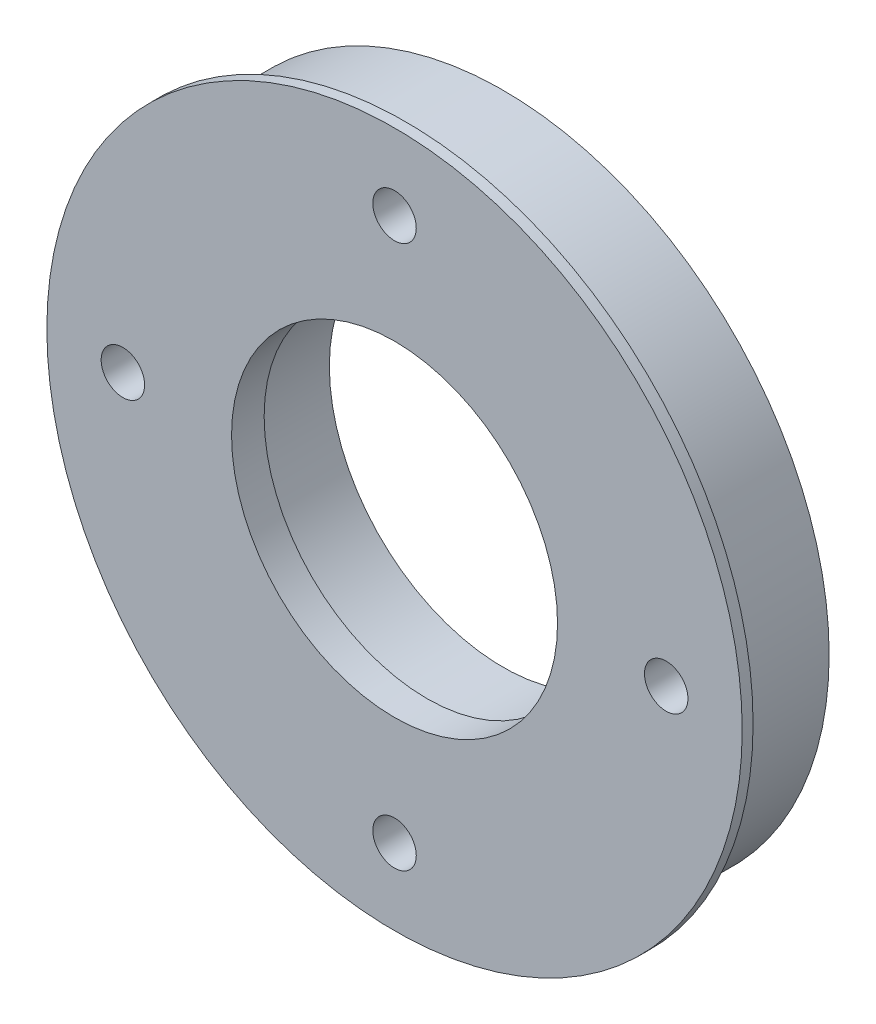
ISO-10303-21;
HEADER;
FILE_DESCRIPTION(('STEP AP214'),'2;1');
FILE_NAME('part.step','',(''),(''),'','','');
FILE_SCHEMA(('AUTOMOTIVE_DESIGN { 1 0 10303 214 1 1 1 1 }'));
ENDSEC;
DATA;
#1=APPLICATION_CONTEXT('core data for automotive mechanical design processes');
#2=APPLICATION_PROTOCOL_DEFINITION('international standard','automotive_design',2000,#1);
#3=PRODUCT_CONTEXT('',#1,'mechanical');
#4=PRODUCT('Part','Part','',(#3));
#5=PRODUCT_RELATED_PRODUCT_CATEGORY('part','',(#4));
#6=PRODUCT_DEFINITION_FORMATION('','',#4);
#7=PRODUCT_DEFINITION_CONTEXT('part definition',#1,'design');
#8=PRODUCT_DEFINITION('design','',#6,#7);
#9=PRODUCT_DEFINITION_SHAPE('','',#8);
#10=(LENGTH_UNIT() NAMED_UNIT(*) SI_UNIT(.MILLI.,.METRE.));
#11=(NAMED_UNIT(*) PLANE_ANGLE_UNIT() SI_UNIT($,.RADIAN.));
#12=(NAMED_UNIT(*) SI_UNIT($,.STERADIAN.) SOLID_ANGLE_UNIT());
#13=UNCERTAINTY_MEASURE_WITH_UNIT(LENGTH_MEASURE(1.E-05),#10,'distance_accuracy_value','');
#14=(GEOMETRIC_REPRESENTATION_CONTEXT(3) GLOBAL_UNCERTAINTY_ASSIGNED_CONTEXT((#13)) GLOBAL_UNIT_ASSIGNED_CONTEXT((#10,
#11,#12)) REPRESENTATION_CONTEXT('',''));
#15=CARTESIAN_POINT('',(0.,0.,0.));
#16=DIRECTION('',(0.,0.,1.));
#17=DIRECTION('',(1.,0.,0.));
#18=AXIS2_PLACEMENT_3D('',#15,#16,#17);
#19=CARTESIAN_POINT('',(0.,0.,-7.));
#20=DIRECTION('',(0.,0.,1.));
#21=DIRECTION('',(1.,0.,0.));
#22=AXIS2_PLACEMENT_3D('',#19,#20,#21);
#23=CYLINDRICAL_SURFACE('',#22,29.9974);
#24=CARTESIAN_POINT('',(0.,0.,2.));
#25=DIRECTION('',(0.,0.,1.));
#26=DIRECTION('',(1.,0.,0.));
#27=AXIS2_PLACEMENT_3D('',#24,#25,#26);
#28=CIRCLE('',#27,29.9974);
#29=CARTESIAN_POINT('',(29.9974,0.,2.));
#30=VERTEX_POINT('',#29);
#31=EDGE_CURVE('E63',#30,#30,#28,.F.);
#32=ORIENTED_EDGE('',*,*,#31,.T.);
#33=EDGE_LOOP('',(#32));
#34=FACE_BOUND('',#33,.T.);
#35=CARTESIAN_POINT('',(0.,0.,-7.));
#36=DIRECTION('',(0.,0.,1.));
#37=DIRECTION('',(1.,0.,0.));
#38=AXIS2_PLACEMENT_3D('',#35,#36,#37);
#39=CIRCLE('',#38,29.9974);
#40=CARTESIAN_POINT('',(29.9974,0.,-7.));
#41=VERTEX_POINT('',#40);
#42=EDGE_CURVE('E11',#41,#41,#39,.T.);
#43=ORIENTED_EDGE('',*,*,#42,.T.);
#44=EDGE_LOOP('',(#43));
#45=FACE_BOUND('',#44,.T.);
#46=ADVANCED_FACE('F50',(#34,#45),#23,.T.);
#47=CARTESIAN_POINT('',(25.,0.,-10.));
#48=DIRECTION('',(0.,0.,1.));
#49=DIRECTION('',(1.,0.,0.));
#50=AXIS2_PLACEMENT_3D('',#47,#48,#49);
#51=CYLINDRICAL_SURFACE('',#50,2.);
#52=CARTESIAN_POINT('',(25.,0.,3.));
#53=DIRECTION('',(0.,0.,1.));
#54=DIRECTION('',(1.,0.,0.));
#55=AXIS2_PLACEMENT_3D('',#52,#53,#54);
#56=CIRCLE('',#55,2.);
#57=CARTESIAN_POINT('',(27.,0.,3.));
#58=VERTEX_POINT('',#57);
#59=EDGE_CURVE('E54',#58,#58,#56,.T.);
#60=ORIENTED_EDGE('',*,*,#59,.T.);
#61=EDGE_LOOP('',(#60));
#62=FACE_BOUND('',#61,.T.);
#63=CARTESIAN_POINT('',(25.,0.,-7.));
#64=DIRECTION('',(0.,0.,-1.));
#65=DIRECTION('',(-1.,0.,0.));
#66=AXIS2_PLACEMENT_3D('',#63,#64,#65);
#67=CIRCLE('',#66,2.);
#68=CARTESIAN_POINT('',(23.,0.,-7.));
#69=VERTEX_POINT('',#68);
#70=EDGE_CURVE('E121',#69,#69,#67,.F.);
#71=ORIENTED_EDGE('',*,*,#70,.F.);
#72=EDGE_LOOP('',(#71));
#73=FACE_BOUND('',#72,.T.);
#74=ADVANCED_FACE('F153',(#62,#73),#51,.F.);
#75=CARTESIAN_POINT('',(0.,-25.,-10.));
#76=DIRECTION('',(0.,0.,1.));
#77=DIRECTION('',(1.,0.,0.));
#78=AXIS2_PLACEMENT_3D('',#75,#76,#77);
#79=CYLINDRICAL_SURFACE('',#78,2.00000000000001);
#80=CARTESIAN_POINT('',(0.,-25.,3.));
#81=DIRECTION('',(0.,0.,1.));
#82=DIRECTION('',(1.,0.,0.));
#83=AXIS2_PLACEMENT_3D('',#80,#81,#82);
#84=CIRCLE('',#83,2.00000000000001);
#85=CARTESIAN_POINT('',(2.,-25.,3.));
#86=VERTEX_POINT('',#85);
#87=EDGE_CURVE('E67',#86,#86,#84,.T.);
#88=ORIENTED_EDGE('',*,*,#87,.T.);
#89=EDGE_LOOP('',(#88));
#90=FACE_BOUND('',#89,.T.);
#91=CARTESIAN_POINT('',(0.,-25.,-7.));
#92=DIRECTION('',(0.,0.,-1.));
#93=DIRECTION('',(-1.,0.,0.));
#94=AXIS2_PLACEMENT_3D('',#91,#92,#93);
#95=CIRCLE('',#94,2.00000000000001);
#96=CARTESIAN_POINT('',(-2.00000000000001,-25.,-7.));
#97=VERTEX_POINT('',#96);
#98=EDGE_CURVE('E123',#97,#97,#95,.F.);
#99=ORIENTED_EDGE('',*,*,#98,.F.);
#100=EDGE_LOOP('',(#99));
#101=FACE_BOUND('',#100,.T.);
#102=ADVANCED_FACE('F149',(#90,#101),#79,.F.);
#103=CARTESIAN_POINT('',(-25.,0.,-10.));
#104=DIRECTION('',(0.,0.,1.));
#105=DIRECTION('',(1.,0.,0.));
#106=AXIS2_PLACEMENT_3D('',#103,#104,#105);
#107=CYLINDRICAL_SURFACE('',#106,2.);
#108=CARTESIAN_POINT('',(-25.,0.,3.));
#109=DIRECTION('',(0.,0.,1.));
#110=DIRECTION('',(1.,0.,0.));
#111=AXIS2_PLACEMENT_3D('',#108,#109,#110);
#112=CIRCLE('',#111,2.);
#113=CARTESIAN_POINT('',(-23.,0.,3.));
#114=VERTEX_POINT('',#113);
#115=EDGE_CURVE('E70',#114,#114,#112,.T.);
#116=ORIENTED_EDGE('',*,*,#115,.T.);
#117=EDGE_LOOP('',(#116));
#118=FACE_BOUND('',#117,.T.);
#119=CARTESIAN_POINT('',(-25.,0.,-7.));
#120=DIRECTION('',(0.,0.,-1.));
#121=DIRECTION('',(-1.,0.,0.));
#122=AXIS2_PLACEMENT_3D('',#119,#120,#121);
#123=CIRCLE('',#122,2.);
#124=CARTESIAN_POINT('',(-27.,0.,-7.));
#125=VERTEX_POINT('',#124);
#126=EDGE_CURVE('E127',#125,#125,#123,.F.);
#127=ORIENTED_EDGE('',*,*,#126,.F.);
#128=EDGE_LOOP('',(#127));
#129=FACE_BOUND('',#128,.T.);
#130=ADVANCED_FACE('F140',(#118,#129),#107,.F.);
#131=CARTESIAN_POINT('',(0.,25.,-10.));
#132=DIRECTION('',(0.,0.,1.));
#133=DIRECTION('',(1.,0.,0.));
#134=AXIS2_PLACEMENT_3D('',#131,#132,#133);
#135=CYLINDRICAL_SURFACE('',#134,2.00000000000001);
#136=CARTESIAN_POINT('',(0.,25.,3.));
#137=DIRECTION('',(0.,0.,1.));
#138=DIRECTION('',(1.,0.,0.));
#139=AXIS2_PLACEMENT_3D('',#136,#137,#138);
#140=CIRCLE('',#139,2.00000000000001);
#141=CARTESIAN_POINT('',(2.,25.,3.));
#142=VERTEX_POINT('',#141);
#143=EDGE_CURVE('E73',#142,#142,#140,.T.);
#144=ORIENTED_EDGE('',*,*,#143,.T.);
#145=EDGE_LOOP('',(#144));
#146=FACE_BOUND('',#145,.T.);
#147=CARTESIAN_POINT('',(0.,25.,-7.));
#148=DIRECTION('',(0.,0.,-1.));
#149=DIRECTION('',(-1.,0.,0.));
#150=AXIS2_PLACEMENT_3D('',#147,#148,#149);
#151=CIRCLE('',#150,2.00000000000001);
#152=CARTESIAN_POINT('',(-2.00000000000001,25.,-7.));
#153=VERTEX_POINT('',#152);
#154=EDGE_CURVE('E132',#153,#153,#151,.F.);
#155=ORIENTED_EDGE('',*,*,#154,.F.);
#156=EDGE_LOOP('',(#155));
#157=FACE_BOUND('',#156,.T.);
#158=ADVANCED_FACE('F138',(#146,#157),#135,.F.);
#159=CARTESIAN_POINT('',(0.,0.,-7.));
#160=DIRECTION('',(0.,0.,1.));
#161=DIRECTION('',(1.,0.,0.));
#162=AXIS2_PLACEMENT_3D('',#159,#160,#161);
#163=PLANE('',#162);
#164=CARTESIAN_POINT('',(0.,0.,-7.));
#165=DIRECTION('',(0.,0.,1.));
#166=DIRECTION('',(1.,0.,0.));
#167=AXIS2_PLACEMENT_3D('',#164,#165,#166);
#168=CIRCLE('',#167,16.);
#169=CARTESIAN_POINT('',(16.,0.,-7.));
#170=VERTEX_POINT('',#169);
#171=EDGE_CURVE('E58',#170,#170,#168,.T.);
#172=ORIENTED_EDGE('',*,*,#171,.T.);
#173=EDGE_LOOP('',(#172));
#174=FACE_BOUND('',#173,.T.);
#175=ORIENTED_EDGE('',*,*,#42,.F.);
#176=EDGE_LOOP('',(#175));
#177=FACE_BOUND('',#176,.T.);
#178=ORIENTED_EDGE('',*,*,#98,.T.);
#179=EDGE_LOOP('',(#178));
#180=FACE_BOUND('',#179,.T.);
#181=ORIENTED_EDGE('',*,*,#126,.T.);
#182=EDGE_LOOP('',(#181));
#183=FACE_BOUND('',#182,.T.);
#184=ORIENTED_EDGE('',*,*,#154,.T.);
#185=EDGE_LOOP('',(#184));
#186=FACE_BOUND('',#185,.T.);
#187=ORIENTED_EDGE('',*,*,#70,.T.);
#188=EDGE_LOOP('',(#187));
#189=FACE_BOUND('',#188,.T.);
#190=ADVANCED_FACE('F136',(#174,#177,#180,#183,#186,#189),#163,.F.);
#191=CARTESIAN_POINT('',(1.13985098899291E-13,-1.1836284832237E-13,-1.));
#192=DIRECTION('',(0.,0.,1.));
#193=DIRECTION('',(1.,0.,0.));
#194=AXIS2_PLACEMENT_3D('',#191,#192,#193);
#195=CYLINDRICAL_SURFACE('',#194,15.0000000000005);
#196=CARTESIAN_POINT('',(1.13985098899291E-13,-1.1836284832237E-13,0.));
#197=DIRECTION('',(0.,0.,-1.));
#198=DIRECTION('',(-1.,0.,0.));
#199=AXIS2_PLACEMENT_3D('',#196,#197,#198);
#200=CIRCLE('',#199,15.0000000000005);
#201=CARTESIAN_POINT('',(-15.0000000000004,-1.1836284832237E-13,0.));
#202=VERTEX_POINT('',#201);
#203=EDGE_CURVE('E78',#202,#202,#200,.T.);
#204=ORIENTED_EDGE('',*,*,#203,.T.);
#205=EDGE_LOOP('',(#204));
#206=FACE_BOUND('',#205,.T.);
#207=CARTESIAN_POINT('',(1.13985098899291E-13,-1.1836284832237E-13,3.));
#208=DIRECTION('',(0.,0.,1.));
#209=DIRECTION('',(1.,0.,0.));
#210=AXIS2_PLACEMENT_3D('',#207,#208,#209);
#211=CIRCLE('',#210,15.0000000000005);
#212=CARTESIAN_POINT('',(15.0000000000006,-1.1836284832237E-13,3.));
#213=VERTEX_POINT('',#212);
#214=EDGE_CURVE('E71',#213,#213,#211,.T.);
#215=ORIENTED_EDGE('',*,*,#214,.T.);
#216=EDGE_LOOP('',(#215));
#217=FACE_BOUND('',#216,.T.);
#218=ADVANCED_FACE('F146',(#206,#217),#195,.F.);
#219=CARTESIAN_POINT('',(0.,0.,-7.));
#220=DIRECTION('',(0.,0.,1.));
#221=DIRECTION('',(1.,0.,0.));
#222=AXIS2_PLACEMENT_3D('',#219,#220,#221);
#223=CYLINDRICAL_SURFACE('',#222,16.);
#224=ORIENTED_EDGE('',*,*,#171,.F.);
#225=EDGE_LOOP('',(#224));
#226=FACE_BOUND('',#225,.T.);
#227=CARTESIAN_POINT('',(0.,0.,0.));
#228=DIRECTION('',(0.,0.,-1.));
#229=DIRECTION('',(-1.,0.,0.));
#230=AXIS2_PLACEMENT_3D('',#227,#228,#229);
#231=CIRCLE('',#230,16.);
#232=CARTESIAN_POINT('',(-16.,0.,0.));
#233=VERTEX_POINT('',#232);
#234=EDGE_CURVE('E82',#233,#233,#231,.T.);
#235=ORIENTED_EDGE('',*,*,#234,.F.);
#236=EDGE_LOOP('',(#235));
#237=FACE_BOUND('',#236,.T.);
#238=ADVANCED_FACE('F52',(#226,#237),#223,.F.);
#239=CARTESIAN_POINT('',(0.,0.,3.));
#240=DIRECTION('',(0.,0.,1.));
#241=DIRECTION('',(1.,0.,0.));
#242=AXIS2_PLACEMENT_3D('',#239,#240,#241);
#243=PLANE('',#242);
#244=ORIENTED_EDGE('',*,*,#59,.F.);
#245=EDGE_LOOP('',(#244));
#246=FACE_BOUND('',#245,.T.);
#247=ORIENTED_EDGE('',*,*,#143,.F.);
#248=EDGE_LOOP('',(#247));
#249=FACE_BOUND('',#248,.T.);
#250=ORIENTED_EDGE('',*,*,#115,.F.);
#251=EDGE_LOOP('',(#250));
#252=FACE_BOUND('',#251,.T.);
#253=ORIENTED_EDGE('',*,*,#87,.F.);
#254=EDGE_LOOP('',(#253));
#255=FACE_BOUND('',#254,.T.);
#256=CARTESIAN_POINT('',(0.,0.,3.));
#257=DIRECTION('',(0.,0.,1.));
#258=DIRECTION('',(1.,0.,0.));
#259=AXIS2_PLACEMENT_3D('',#256,#257,#258);
#260=CIRCLE('',#259,31.9974);
#261=CARTESIAN_POINT('',(31.9974,0.,3.));
#262=VERTEX_POINT('',#261);
#263=EDGE_CURVE('E87',#262,#262,#260,.T.);
#264=ORIENTED_EDGE('',*,*,#263,.T.);
#265=EDGE_LOOP('',(#264));
#266=FACE_BOUND('',#265,.T.);
#267=ORIENTED_EDGE('',*,*,#214,.F.);
#268=EDGE_LOOP('',(#267));
#269=FACE_BOUND('',#268,.T.);
#270=ADVANCED_FACE('F104',(#246,#249,#252,#255,#266,#269),#243,.T.);
#271=CARTESIAN_POINT('',(0.,0.,2.));
#272=DIRECTION('',(0.,0.,1.));
#273=DIRECTION('',(1.,0.,0.));
#274=AXIS2_PLACEMENT_3D('',#271,#272,#273);
#275=PLANE('',#274);
#276=ORIENTED_EDGE('',*,*,#31,.F.);
#277=EDGE_LOOP('',(#276));
#278=FACE_BOUND('',#277,.T.);
#279=CARTESIAN_POINT('',(0.,0.,2.));
#280=DIRECTION('',(0.,0.,1.));
#281=DIRECTION('',(1.,0.,0.));
#282=AXIS2_PLACEMENT_3D('',#279,#280,#281);
#283=CIRCLE('',#282,31.9974);
#284=CARTESIAN_POINT('',(31.9974,0.,2.));
#285=VERTEX_POINT('',#284);
#286=EDGE_CURVE('E92',#285,#285,#283,.T.);
#287=ORIENTED_EDGE('',*,*,#286,.F.);
#288=EDGE_LOOP('',(#287));
#289=FACE_BOUND('',#288,.T.);
#290=ADVANCED_FACE('F100',(#278,#289),#275,.F.);
#291=CARTESIAN_POINT('',(0.,0.,2.));
#292=DIRECTION('',(0.,0.,1.));
#293=DIRECTION('',(1.,0.,0.));
#294=AXIS2_PLACEMENT_3D('',#291,#292,#293);
#295=CYLINDRICAL_SURFACE('',#294,31.9974);
#296=ORIENTED_EDGE('',*,*,#286,.T.);
#297=EDGE_LOOP('',(#296));
#298=FACE_BOUND('',#297,.T.);
#299=ORIENTED_EDGE('',*,*,#263,.F.);
#300=EDGE_LOOP('',(#299));
#301=FACE_BOUND('',#300,.T.);
#302=ADVANCED_FACE('F103',(#298,#301),#295,.T.);
#303=CARTESIAN_POINT('',(0.,0.,0.));
#304=DIRECTION('',(0.,0.,-1.));
#305=DIRECTION('',(-1.,0.,0.));
#306=AXIS2_PLACEMENT_3D('',#303,#304,#305);
#307=PLANE('',#306);
#308=ORIENTED_EDGE('',*,*,#203,.F.);
#309=EDGE_LOOP('',(#308));
#310=FACE_BOUND('',#309,.T.);
#311=ORIENTED_EDGE('',*,*,#234,.T.);
#312=EDGE_LOOP('',(#311));
#313=FACE_BOUND('',#312,.T.);
#314=ADVANCED_FACE('F110',(#310,#313),#307,.T.);
#315=CLOSED_SHELL('',(#46,#74,#102,#130,#158,#190,#218,#238,#270,#290,#302,#314));
#316=MANIFOLD_SOLID_BREP('B2',#315);
#317=ADVANCED_BREP_SHAPE_REPRESENTATION('',(#18,#316),#14);
#318=SHAPE_DEFINITION_REPRESENTATION(#9,#317);
ENDSEC;
END-ISO-10303-21;
